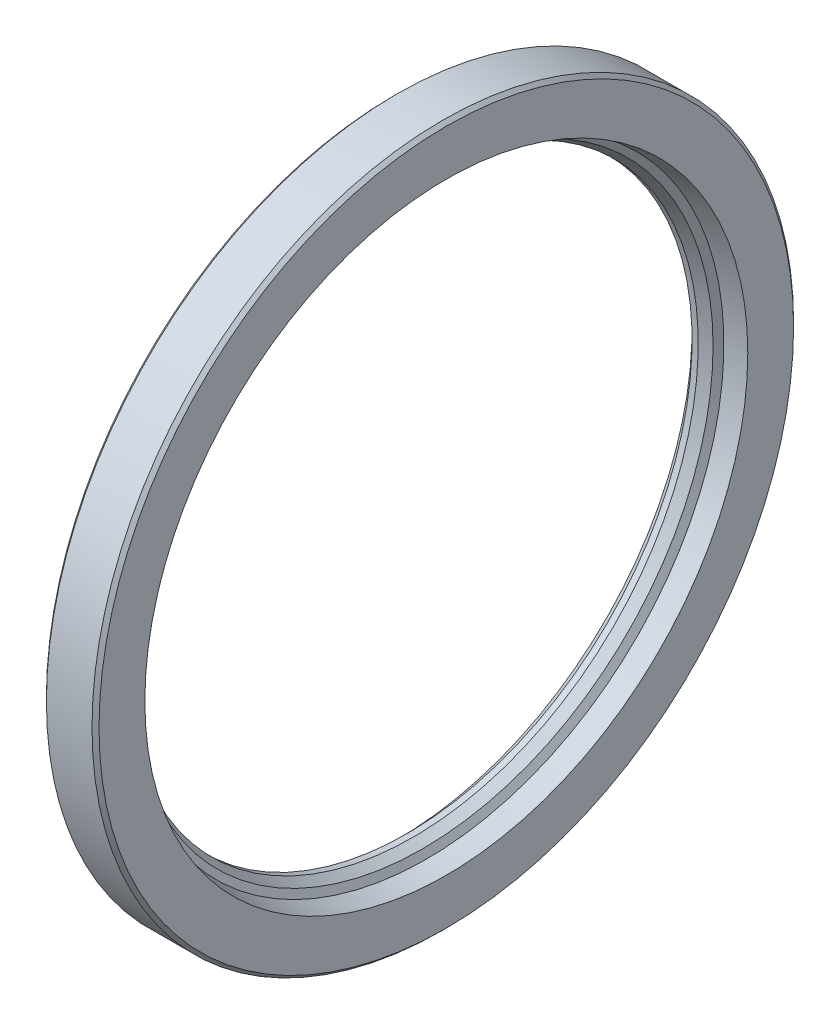
ISO-10303-21;
HEADER;
FILE_DESCRIPTION(('STEP AP214'),'2;1');
FILE_NAME('part.step','',(''),(''),'','','');
FILE_SCHEMA(('AUTOMOTIVE_DESIGN { 1 0 10303 214 1 1 1 1 }'));
ENDSEC;
DATA;
#1=APPLICATION_CONTEXT('core data for automotive mechanical design processes');
#2=APPLICATION_PROTOCOL_DEFINITION('international standard','automotive_design',2000,#1);
#3=PRODUCT_CONTEXT('',#1,'mechanical');
#4=PRODUCT('Part','Part','',(#3));
#5=PRODUCT_RELATED_PRODUCT_CATEGORY('part','',(#4));
#6=PRODUCT_DEFINITION_FORMATION('','',#4);
#7=PRODUCT_DEFINITION_CONTEXT('part definition',#1,'design');
#8=PRODUCT_DEFINITION('design','',#6,#7);
#9=PRODUCT_DEFINITION_SHAPE('','',#8);
#10=(LENGTH_UNIT() NAMED_UNIT(*) SI_UNIT(.MILLI.,.METRE.));
#11=(NAMED_UNIT(*) PLANE_ANGLE_UNIT() SI_UNIT($,.RADIAN.));
#12=(NAMED_UNIT(*) SI_UNIT($,.STERADIAN.) SOLID_ANGLE_UNIT());
#13=UNCERTAINTY_MEASURE_WITH_UNIT(LENGTH_MEASURE(1.E-05),#10,'distance_accuracy_value','');
#14=(GEOMETRIC_REPRESENTATION_CONTEXT(3) GLOBAL_UNCERTAINTY_ASSIGNED_CONTEXT((#13)) GLOBAL_UNIT_ASSIGNED_CONTEXT((#10,
#11,#12)) REPRESENTATION_CONTEXT('',''));
#15=CARTESIAN_POINT('',(0.,0.,0.));
#16=DIRECTION('',(0.,0.,1.));
#17=DIRECTION('',(1.,0.,0.));
#18=AXIS2_PLACEMENT_3D('',#15,#16,#17);
#19=CARTESIAN_POINT('',(-2.24999999999999,0.,0.));
#20=DIRECTION('',(-1.,0.,0.));
#21=DIRECTION('',(0.,0.,1.));
#22=AXIS2_PLACEMENT_3D('',#19,#20,#21);
#23=TOROIDAL_SURFACE('',#22,68.75,1.40625);
#24=CARTESIAN_POINT('',(-2.24999999999999,0.,70.15625));
#25=VERTEX_POINT('',#24);
#26=VERTEX_LOOP('',#25);
#27=FACE_BOUND('',#26,.T.);
#28=ADVANCED_FACE('F41',(#27),#23,.T.);
#29=CLOSED_SHELL('',(#28));
#30=MANIFOLD_SOLID_BREP('B2',#29);
#31=CARTESIAN_POINT('',(-6.,0.,0.));
#32=DIRECTION('',(-1.,0.,0.));
#33=DIRECTION('',(0.,0.,1.));
#34=AXIS2_PLACEMENT_3D('',#31,#32,#33);
#35=CONICAL_SURFACE('',#34,77.1875,0.174532925199427);
#36=CARTESIAN_POINT('',(-0.787057250155898,0.,0.));
#37=DIRECTION('',(-1.,0.,0.));
#38=DIRECTION('',(0.,0.,1.));
#39=AXIS2_PLACEMENT_3D('',#36,#37,#38);
#40=CIRCLE('',#39,76.2683175443139);
#41=CARTESIAN_POINT('',(-0.787057250155898,0.,76.2683175443139));
#42=VERTEX_POINT('',#41);
#43=EDGE_CURVE('E40',#42,#42,#40,.T.);
#44=ORIENTED_EDGE('',*,*,#43,.F.);
#45=EDGE_LOOP('',(#44));
#46=FACE_BOUND('',#45,.T.);
#47=CARTESIAN_POINT('',(-6.,0.,0.));
#48=DIRECTION('',(-1.,0.,0.));
#49=DIRECTION('',(0.,0.,1.));
#50=AXIS2_PLACEMENT_3D('',#47,#48,#49);
#51=CIRCLE('',#50,77.1875);
#52=CARTESIAN_POINT('',(-6.,0.,77.1875));
#53=VERTEX_POINT('',#52);
#54=EDGE_CURVE('E112',#53,#53,#51,.T.);
#55=ORIENTED_EDGE('',*,*,#54,.T.);
#56=EDGE_LOOP('',(#55));
#57=FACE_BOUND('',#56,.T.);
#58=ADVANCED_FACE('F54',(#46,#57),#35,.F.);
#59=CARTESIAN_POINT('',(-1.03125000000001,0.,0.));
#60=DIRECTION('',(-1.,0.,0.));
#61=DIRECTION('',(0.,0.,1.));
#62=AXIS2_PLACEMENT_3D('',#59,#60,#61);
#63=TOROIDAL_SURFACE('',#62,74.8834316416405,1.40625000000001);
#64=CARTESIAN_POINT('',(0.374999999999991,0.,0.));
#65=DIRECTION('',(-1.,0.,0.));
#66=DIRECTION('',(0.,0.,1.));
#67=AXIS2_PLACEMENT_3D('',#64,#65,#66);
#68=CIRCLE('',#67,74.8834316416405);
#69=CARTESIAN_POINT('',(0.374999999999991,0.,74.8834316416405));
#70=VERTEX_POINT('',#69);
#71=EDGE_CURVE('E60',#70,#70,#68,.T.);
#72=ORIENTED_EDGE('',*,*,#71,.F.);
#73=EDGE_LOOP('',(#72));
#74=FACE_BOUND('',#73,.T.);
#75=ORIENTED_EDGE('',*,*,#43,.T.);
#76=EDGE_LOOP('',(#75));
#77=FACE_BOUND('',#76,.T.);
#78=ADVANCED_FACE('F209',(#74,#77),#63,.F.);
#79=CARTESIAN_POINT('',(0.374999999999991,69.0058883741478,0.));
#80=DIRECTION('',(1.,0.,0.));
#81=DIRECTION('',(0.,0.,-1.));
#82=AXIS2_PLACEMENT_3D('',#79,#80,#81);
#83=PLANE('',#82);
#84=CARTESIAN_POINT('',(0.374999999999991,0.,0.));
#85=DIRECTION('',(-1.,0.,0.));
#86=DIRECTION('',(0.,0.,1.));
#87=AXIS2_PLACEMENT_3D('',#84,#85,#86);
#88=CIRCLE('',#87,69.0058883741478);
#89=CARTESIAN_POINT('',(0.374999999999991,0.,69.0058883741478));
#90=VERTEX_POINT('',#89);
#91=EDGE_CURVE('E64',#90,#90,#88,.T.);
#92=ORIENTED_EDGE('',*,*,#91,.F.);
#93=EDGE_LOOP('',(#92));
#94=FACE_BOUND('',#93,.T.);
#95=ORIENTED_EDGE('',*,*,#71,.T.);
#96=EDGE_LOOP('',(#95));
#97=FACE_BOUND('',#96,.T.);
#98=ADVANCED_FACE('F204',(#94,#97),#83,.F.);
#99=CARTESIAN_POINT('',(0.374999999999991,0.,0.));
#100=DIRECTION('',(1.,0.,0.));
#101=DIRECTION('',(0.,0.,-1.));
#102=AXIS2_PLACEMENT_3D('',#99,#100,#101);
#103=CONICAL_SURFACE('',#102,69.0058883741478,0.206953588034279);
#104=CARTESIAN_POINT('',(-0.84374999999999,0.,0.));
#105=DIRECTION('',(-1.,0.,0.));
#106=DIRECTION('',(0.,0.,1.));
#107=AXIS2_PLACEMENT_3D('',#104,#105,#106);
#108=CIRCLE('',#107,68.75);
#109=CARTESIAN_POINT('',(-0.84374999999999,0.,68.75));
#110=VERTEX_POINT('',#109);
#111=EDGE_CURVE('E68',#110,#110,#108,.T.);
#112=ORIENTED_EDGE('',*,*,#111,.F.);
#113=EDGE_LOOP('',(#112));
#114=FACE_BOUND('',#113,.T.);
#115=ORIENTED_EDGE('',*,*,#91,.T.);
#116=EDGE_LOOP('',(#115));
#117=FACE_BOUND('',#116,.T.);
#118=ADVANCED_FACE('F198',(#114,#117),#103,.T.);
#119=CARTESIAN_POINT('',(-2.24999999999999,0.,0.));
#120=DIRECTION('',(-1.,0.,0.));
#121=DIRECTION('',(0.,0.,1.));
#122=AXIS2_PLACEMENT_3D('',#119,#120,#121);
#123=TOROIDAL_SURFACE('',#122,68.75,1.40625);
#124=CARTESIAN_POINT('',(-3.65624999999999,0.,0.));
#125=DIRECTION('',(-1.,0.,0.));
#126=DIRECTION('',(0.,0.,1.));
#127=AXIS2_PLACEMENT_3D('',#124,#125,#126);
#128=CIRCLE('',#127,68.75);
#129=CARTESIAN_POINT('',(-3.65624999999999,0.,68.75));
#130=VERTEX_POINT('',#129);
#131=EDGE_CURVE('E73',#130,#130,#128,.T.);
#132=ORIENTED_EDGE('',*,*,#131,.F.);
#133=EDGE_LOOP('',(#132));
#134=FACE_BOUND('',#133,.T.);
#135=ORIENTED_EDGE('',*,*,#111,.T.);
#136=EDGE_LOOP('',(#135));
#137=FACE_BOUND('',#136,.T.);
#138=ADVANCED_FACE('F192',(#134,#137),#123,.F.);
#139=CARTESIAN_POINT('',(-3.65624999999999,69.453125,0.));
#140=DIRECTION('',(-1.,0.,0.));
#141=DIRECTION('',(0.,0.,1.));
#142=AXIS2_PLACEMENT_3D('',#139,#140,#141);
#143=PLANE('',#142);
#144=CARTESIAN_POINT('',(-3.65624999999999,0.,0.));
#145=DIRECTION('',(-1.,0.,0.));
#146=DIRECTION('',(0.,0.,1.));
#147=AXIS2_PLACEMENT_3D('',#144,#145,#146);
#148=CIRCLE('',#147,69.453125);
#149=CARTESIAN_POINT('',(-3.65624999999999,0.,69.453125));
#150=VERTEX_POINT('',#149);
#151=EDGE_CURVE('E76',#150,#150,#148,.T.);
#152=ORIENTED_EDGE('',*,*,#151,.F.);
#153=EDGE_LOOP('',(#152));
#154=FACE_BOUND('',#153,.T.);
#155=ORIENTED_EDGE('',*,*,#131,.T.);
#156=EDGE_LOOP('',(#155));
#157=FACE_BOUND('',#156,.T.);
#158=ADVANCED_FACE('F186',(#154,#157),#143,.F.);
#159=CARTESIAN_POINT('',(-6.,0.,0.));
#160=DIRECTION('',(-1.,0.,0.));
#161=DIRECTION('',(0.,0.,1.));
#162=AXIS2_PLACEMENT_3D('',#159,#160,#161);
#163=CYLINDRICAL_SURFACE('',#162,69.453125);
#164=CARTESIAN_POINT('',(-5.06249999999999,0.,0.));
#165=DIRECTION('',(-1.,0.,0.));
#166=DIRECTION('',(0.,0.,1.));
#167=AXIS2_PLACEMENT_3D('',#164,#165,#166);
#168=CIRCLE('',#167,69.453125);
#169=CARTESIAN_POINT('',(-5.06249999999999,0.,69.453125));
#170=VERTEX_POINT('',#169);
#171=EDGE_CURVE('E79',#170,#170,#168,.T.);
#172=ORIENTED_EDGE('',*,*,#171,.F.);
#173=EDGE_LOOP('',(#172));
#174=FACE_BOUND('',#173,.T.);
#175=ORIENTED_EDGE('',*,*,#151,.T.);
#176=EDGE_LOOP('',(#175));
#177=FACE_BOUND('',#176,.T.);
#178=ADVANCED_FACE('F180',(#174,#177),#163,.T.);
#179=CARTESIAN_POINT('',(-5.06249999999999,67.109375,0.));
#180=DIRECTION('',(1.,0.,0.));
#181=DIRECTION('',(0.,0.,-1.));
#182=AXIS2_PLACEMENT_3D('',#179,#180,#181);
#183=PLANE('',#182);
#184=CARTESIAN_POINT('',(-5.06249999999999,0.,0.));
#185=DIRECTION('',(-1.,0.,0.));
#186=DIRECTION('',(0.,0.,1.));
#187=AXIS2_PLACEMENT_3D('',#184,#185,#186);
#188=CIRCLE('',#187,67.109375);
#189=CARTESIAN_POINT('',(-5.06249999999999,0.,67.109375));
#190=VERTEX_POINT('',#189);
#191=EDGE_CURVE('E82',#190,#190,#188,.T.);
#192=ORIENTED_EDGE('',*,*,#191,.F.);
#193=EDGE_LOOP('',(#192));
#194=FACE_BOUND('',#193,.T.);
#195=ORIENTED_EDGE('',*,*,#171,.T.);
#196=EDGE_LOOP('',(#195));
#197=FACE_BOUND('',#196,.T.);
#198=ADVANCED_FACE('F174',(#194,#197),#183,.F.);
#199=CARTESIAN_POINT('',(-5.06249999999999,0.,0.));
#200=DIRECTION('',(-1.,0.,0.));
#201=DIRECTION('',(0.,0.,1.));
#202=AXIS2_PLACEMENT_3D('',#199,#200,#201);
#203=CONICAL_SURFACE('',#202,67.109375,0.785398163397444);
#204=CARTESIAN_POINT('',(-2.95312499999999,0.,0.));
#205=DIRECTION('',(-1.,0.,0.));
#206=DIRECTION('',(0.,0.,1.));
#207=AXIS2_PLACEMENT_3D('',#204,#205,#206);
#208=CIRCLE('',#207,65.);
#209=CARTESIAN_POINT('',(-2.95312499999999,0.,65.));
#210=VERTEX_POINT('',#209);
#211=EDGE_CURVE('E85',#210,#210,#208,.T.);
#212=ORIENTED_EDGE('',*,*,#211,.F.);
#213=EDGE_LOOP('',(#212));
#214=FACE_BOUND('',#213,.T.);
#215=ORIENTED_EDGE('',*,*,#191,.T.);
#216=EDGE_LOOP('',(#215));
#217=FACE_BOUND('',#216,.T.);
#218=ADVANCED_FACE('F168',(#214,#217),#203,.F.);
#219=CARTESIAN_POINT('',(-6.,0.,0.));
#220=DIRECTION('',(-1.,0.,0.));
#221=DIRECTION('',(0.,0.,1.));
#222=AXIS2_PLACEMENT_3D('',#219,#220,#221);
#223=CYLINDRICAL_SURFACE('',#222,65.);
#224=CARTESIAN_POINT('',(-1.54687499999999,0.,0.));
#225=DIRECTION('',(-1.,0.,0.));
#226=DIRECTION('',(0.,0.,1.));
#227=AXIS2_PLACEMENT_3D('',#224,#225,#226);
#228=CIRCLE('',#227,65.);
#229=CARTESIAN_POINT('',(-1.54687499999999,0.,65.));
#230=VERTEX_POINT('',#229);
#231=EDGE_CURVE('E88',#230,#230,#228,.T.);
#232=ORIENTED_EDGE('',*,*,#231,.F.);
#233=EDGE_LOOP('',(#232));
#234=FACE_BOUND('',#233,.T.);
#235=ORIENTED_EDGE('',*,*,#211,.T.);
#236=EDGE_LOOP('',(#235));
#237=FACE_BOUND('',#236,.T.);
#238=ADVANCED_FACE('F162',(#234,#237),#223,.F.);
#239=CARTESIAN_POINT('',(-1.54687499999999,0.,0.));
#240=DIRECTION('',(1.,0.,0.));
#241=DIRECTION('',(0.,0.,-1.));
#242=AXIS2_PLACEMENT_3D('',#239,#240,#241);
#243=CONICAL_SURFACE('',#242,65.,0.523598775598291);
#244=CARTESIAN_POINT('',(0.59407915597482,0.,0.));
#245=DIRECTION('',(-1.,0.,0.));
#246=DIRECTION('',(0.,0.,1.));
#247=AXIS2_PLACEMENT_3D('',#244,#245,#246);
#248=CIRCLE('',#247,66.2360804582747);
#249=CARTESIAN_POINT('',(0.59407915597482,0.,66.2360804582747));
#250=VERTEX_POINT('',#249);
#251=EDGE_CURVE('E91',#250,#250,#248,.T.);
#252=ORIENTED_EDGE('',*,*,#251,.F.);
#253=EDGE_LOOP('',(#252));
#254=FACE_BOUND('',#253,.T.);
#255=ORIENTED_EDGE('',*,*,#231,.T.);
#256=EDGE_LOOP('',(#255));
#257=FACE_BOUND('',#256,.T.);
#258=ADVANCED_FACE('F156',(#254,#257),#243,.F.);
#259=CARTESIAN_POINT('',(0.59407915597482,0.,0.));
#260=DIRECTION('',(1.,0.,0.));
#261=DIRECTION('',(0.,0.,-1.));
#262=AXIS2_PLACEMENT_3D('',#259,#260,#261);
#263=CONICAL_SURFACE('',#262,66.2360804582747,1.0471975511966);
#264=CARTESIAN_POINT('',(1.50000000000001,0.,0.));
#265=DIRECTION('',(-1.,0.,0.));
#266=DIRECTION('',(0.,0.,1.));
#267=AXIS2_PLACEMENT_3D('',#264,#265,#266);
#268=CIRCLE('',#267,67.805181387762);
#269=CARTESIAN_POINT('',(1.50000000000001,0.,67.805181387762));
#270=VERTEX_POINT('',#269);
#271=EDGE_CURVE('E94',#270,#270,#268,.T.);
#272=ORIENTED_EDGE('',*,*,#271,.F.);
#273=EDGE_LOOP('',(#272));
#274=FACE_BOUND('',#273,.T.);
#275=ORIENTED_EDGE('',*,*,#251,.T.);
#276=EDGE_LOOP('',(#275));
#277=FACE_BOUND('',#276,.T.);
#278=ADVANCED_FACE('F150',(#274,#277),#263,.F.);
#279=CARTESIAN_POINT('',(1.50000000000001,0.,0.));
#280=DIRECTION('',(1.,0.,0.));
#281=DIRECTION('',(0.,0.,-1.));
#282=AXIS2_PLACEMENT_3D('',#279,#280,#281);
#283=CONICAL_SURFACE('',#282,67.805181387762,0.206953588034279);
#284=CARTESIAN_POINT('',(6.,0.,0.));
#285=DIRECTION('',(-1.,0.,0.));
#286=DIRECTION('',(0.,0.,1.));
#287=AXIS2_PLACEMENT_3D('',#284,#285,#286);
#288=CIRCLE('',#287,68.75);
#289=CARTESIAN_POINT('',(6.,0.,68.75));
#290=VERTEX_POINT('',#289);
#291=EDGE_CURVE('E97',#290,#290,#288,.T.);
#292=ORIENTED_EDGE('',*,*,#291,.F.);
#293=EDGE_LOOP('',(#292));
#294=FACE_BOUND('',#293,.T.);
#295=ORIENTED_EDGE('',*,*,#271,.T.);
#296=EDGE_LOOP('',(#295));
#297=FACE_BOUND('',#296,.T.);
#298=ADVANCED_FACE('F144',(#294,#297),#283,.F.);
#299=CARTESIAN_POINT('',(6.,79.2,0.));
#300=DIRECTION('',(-1.,0.,0.));
#301=DIRECTION('',(0.,0.,1.));
#302=AXIS2_PLACEMENT_3D('',#299,#300,#301);
#303=PLANE('',#302);
#304=CARTESIAN_POINT('',(6.,0.,0.));
#305=DIRECTION('',(-1.,0.,0.));
#306=DIRECTION('',(0.,0.,1.));
#307=AXIS2_PLACEMENT_3D('',#304,#305,#306);
#308=CIRCLE('',#307,79.2);
#309=CARTESIAN_POINT('',(6.,0.,79.2));
#310=VERTEX_POINT('',#309);
#311=EDGE_CURVE('E100',#310,#310,#308,.T.);
#312=ORIENTED_EDGE('',*,*,#311,.F.);
#313=EDGE_LOOP('',(#312));
#314=FACE_BOUND('',#313,.T.);
#315=ORIENTED_EDGE('',*,*,#291,.T.);
#316=EDGE_LOOP('',(#315));
#317=FACE_BOUND('',#316,.T.);
#318=ADVANCED_FACE('F138',(#314,#317),#303,.F.);
#319=CARTESIAN_POINT('',(6.,0.,0.));
#320=DIRECTION('',(-1.,0.,0.));
#321=DIRECTION('',(0.,0.,1.));
#322=AXIS2_PLACEMENT_3D('',#319,#320,#321);
#323=CONICAL_SURFACE('',#322,79.2,0.785398163397454);
#324=CARTESIAN_POINT('',(5.2,0.,0.));
#325=DIRECTION('',(-1.,0.,0.));
#326=DIRECTION('',(0.,0.,1.));
#327=AXIS2_PLACEMENT_3D('',#324,#325,#326);
#328=CIRCLE('',#327,80.);
#329=CARTESIAN_POINT('',(5.2,0.,80.));
#330=VERTEX_POINT('',#329);
#331=EDGE_CURVE('E103',#330,#330,#328,.T.);
#332=ORIENTED_EDGE('',*,*,#331,.F.);
#333=EDGE_LOOP('',(#332));
#334=FACE_BOUND('',#333,.T.);
#335=ORIENTED_EDGE('',*,*,#311,.T.);
#336=EDGE_LOOP('',(#335));
#337=FACE_BOUND('',#336,.T.);
#338=ADVANCED_FACE('F132',(#334,#337),#323,.T.);
#339=CARTESIAN_POINT('',(-6.,0.,0.));
#340=DIRECTION('',(-1.,0.,0.));
#341=DIRECTION('',(0.,0.,1.));
#342=AXIS2_PLACEMENT_3D('',#339,#340,#341);
#343=CYLINDRICAL_SURFACE('',#342,80.);
#344=CARTESIAN_POINT('',(-5.2,0.,0.));
#345=DIRECTION('',(-1.,0.,0.));
#346=DIRECTION('',(0.,0.,1.));
#347=AXIS2_PLACEMENT_3D('',#344,#345,#346);
#348=CIRCLE('',#347,80.);
#349=CARTESIAN_POINT('',(-5.2,0.,80.));
#350=VERTEX_POINT('',#349);
#351=EDGE_CURVE('E106',#350,#350,#348,.T.);
#352=ORIENTED_EDGE('',*,*,#351,.F.);
#353=EDGE_LOOP('',(#352));
#354=FACE_BOUND('',#353,.T.);
#355=ORIENTED_EDGE('',*,*,#331,.T.);
#356=EDGE_LOOP('',(#355));
#357=FACE_BOUND('',#356,.T.);
#358=ADVANCED_FACE('F126',(#354,#357),#343,.T.);
#359=CARTESIAN_POINT('',(-5.2,0.,0.));
#360=DIRECTION('',(1.,0.,0.));
#361=DIRECTION('',(0.,0.,-1.));
#362=AXIS2_PLACEMENT_3D('',#359,#360,#361);
#363=CONICAL_SURFACE('',#362,80.,0.785398163397448);
#364=CARTESIAN_POINT('',(-6.,0.,0.));
#365=DIRECTION('',(-1.,0.,0.));
#366=DIRECTION('',(0.,0.,1.));
#367=AXIS2_PLACEMENT_3D('',#364,#365,#366);
#368=CIRCLE('',#367,79.2);
#369=CARTESIAN_POINT('',(-6.,0.,79.2));
#370=VERTEX_POINT('',#369);
#371=EDGE_CURVE('E109',#370,#370,#368,.T.);
#372=ORIENTED_EDGE('',*,*,#371,.F.);
#373=EDGE_LOOP('',(#372));
#374=FACE_BOUND('',#373,.T.);
#375=ORIENTED_EDGE('',*,*,#351,.T.);
#376=EDGE_LOOP('',(#375));
#377=FACE_BOUND('',#376,.T.);
#378=ADVANCED_FACE('F120',(#374,#377),#363,.T.);
#379=CARTESIAN_POINT('',(-6.,77.1875,0.));
#380=DIRECTION('',(1.,0.,0.));
#381=DIRECTION('',(0.,0.,-1.));
#382=AXIS2_PLACEMENT_3D('',#379,#380,#381);
#383=PLANE('',#382);
#384=ORIENTED_EDGE('',*,*,#54,.F.);
#385=EDGE_LOOP('',(#384));
#386=FACE_BOUND('',#385,.T.);
#387=ORIENTED_EDGE('',*,*,#371,.T.);
#388=EDGE_LOOP('',(#387));
#389=FACE_BOUND('',#388,.T.);
#390=ADVANCED_FACE('F117',(#386,#389),#383,.F.);
#391=CLOSED_SHELL('',(#58,#78,#98,#118,#138,#158,#178,#198,#218,#238,#258,#278,#298,#318,#338,
#358,#378,#390));
#392=MANIFOLD_SOLID_BREP('B6',#391);
#393=ADVANCED_BREP_SHAPE_REPRESENTATION('',(#18,#30,#392),#14);
#394=SHAPE_DEFINITION_REPRESENTATION(#9,#393);
ENDSEC;
END-ISO-10303-21;
